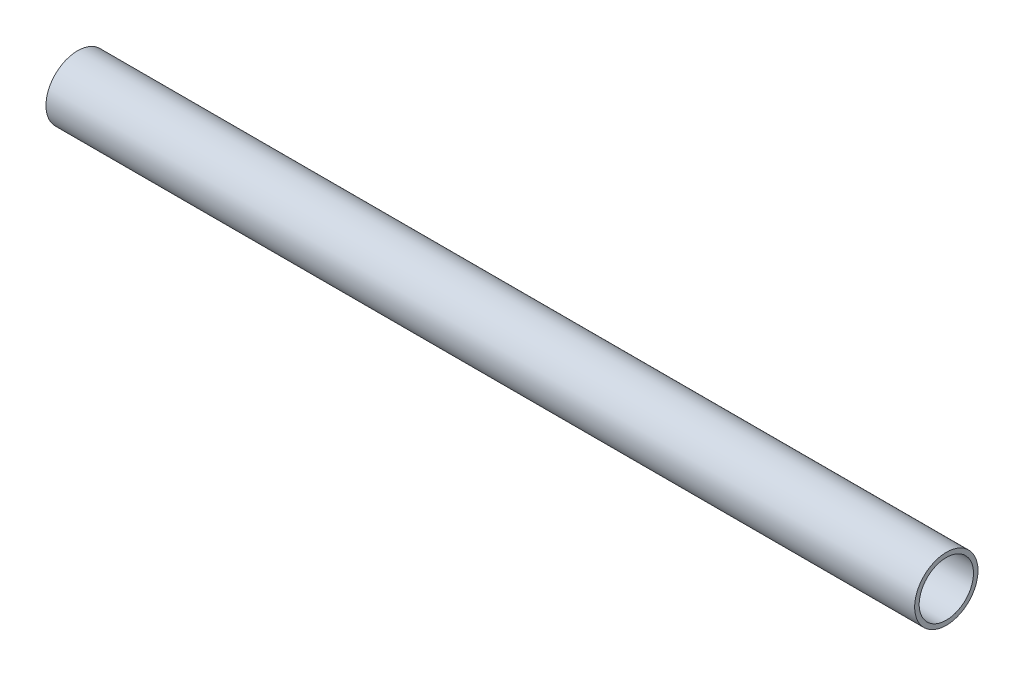
ISO-10303-21;
HEADER;
FILE_DESCRIPTION(('STEP AP214'),'2;1');
FILE_NAME('part.step','',(''),(''),'','','');
FILE_SCHEMA(('AUTOMOTIVE_DESIGN { 1 0 10303 214 1 1 1 1 }'));
ENDSEC;
DATA;
#1=APPLICATION_CONTEXT('core data for automotive mechanical design processes');
#2=APPLICATION_PROTOCOL_DEFINITION('international standard','automotive_design',2000,#1);
#3=PRODUCT_CONTEXT('',#1,'mechanical');
#4=PRODUCT('Part','Part','',(#3));
#5=PRODUCT_RELATED_PRODUCT_CATEGORY('part','',(#4));
#6=PRODUCT_DEFINITION_FORMATION('','',#4);
#7=PRODUCT_DEFINITION_CONTEXT('part definition',#1,'design');
#8=PRODUCT_DEFINITION('design','',#6,#7);
#9=PRODUCT_DEFINITION_SHAPE('','',#8);
#10=(LENGTH_UNIT() NAMED_UNIT(*) SI_UNIT(.MILLI.,.METRE.));
#11=(NAMED_UNIT(*) PLANE_ANGLE_UNIT() SI_UNIT($,.RADIAN.));
#12=(NAMED_UNIT(*) SI_UNIT($,.STERADIAN.) SOLID_ANGLE_UNIT());
#13=UNCERTAINTY_MEASURE_WITH_UNIT(LENGTH_MEASURE(1.E-05),#10,'distance_accuracy_value','');
#14=(GEOMETRIC_REPRESENTATION_CONTEXT(3) GLOBAL_UNCERTAINTY_ASSIGNED_CONTEXT((#13)) GLOBAL_UNIT_ASSIGNED_CONTEXT((#10,
#11,#12)) REPRESENTATION_CONTEXT('',''));
#15=CARTESIAN_POINT('',(0.,0.,0.));
#16=DIRECTION('',(0.,0.,1.));
#17=DIRECTION('',(1.,0.,0.));
#18=AXIS2_PLACEMENT_3D('',#15,#16,#17);
#19=CARTESIAN_POINT('',(609.6,0.,0.));
#20=DIRECTION('',(1.,0.,0.));
#21=DIRECTION('',(0.,0.,-1.));
#22=AXIS2_PLACEMENT_3D('',#19,#20,#21);
#23=PLANE('',#22);
#24=CARTESIAN_POINT('',(609.6,0.,0.));
#25=DIRECTION('',(1.,0.,0.));
#26=DIRECTION('',(0.,0.,-1.));
#27=AXIS2_PLACEMENT_3D('',#24,#25,#26);
#28=CIRCLE('',#27,44.45);
#29=CARTESIAN_POINT('',(609.6,0.,-44.45));
#30=VERTEX_POINT('',#29);
#31=EDGE_CURVE('E10',#30,#30,#28,.T.);
#32=ORIENTED_EDGE('',*,*,#31,.T.);
#33=EDGE_LOOP('',(#32));
#34=FACE_BOUND('',#33,.T.);
#35=CARTESIAN_POINT('',(609.6,0.,0.));
#36=DIRECTION('',(1.,0.,0.));
#37=DIRECTION('',(0.,0.,-1.));
#38=AXIS2_PLACEMENT_3D('',#35,#36,#37);
#39=CIRCLE('',#38,38.1);
#40=CARTESIAN_POINT('',(609.6,0.,-38.1));
#41=VERTEX_POINT('',#40);
#42=EDGE_CURVE('E42',#41,#41,#39,.T.);
#43=ORIENTED_EDGE('',*,*,#42,.F.);
#44=EDGE_LOOP('',(#43));
#45=FACE_BOUND('',#44,.T.);
#46=ADVANCED_FACE('F31',(#34,#45),#23,.T.);
#47=CARTESIAN_POINT('',(-609.6,0.,0.));
#48=DIRECTION('',(1.,0.,0.));
#49=DIRECTION('',(0.,0.,-1.));
#50=AXIS2_PLACEMENT_3D('',#47,#48,#49);
#51=PLANE('',#50);
#52=CARTESIAN_POINT('',(-609.6,0.,0.));
#53=DIRECTION('',(1.,0.,0.));
#54=DIRECTION('',(0.,0.,-1.));
#55=AXIS2_PLACEMENT_3D('',#52,#53,#54);
#56=CIRCLE('',#55,44.45);
#57=CARTESIAN_POINT('',(-609.6,0.,-44.45));
#58=VERTEX_POINT('',#57);
#59=EDGE_CURVE('E35',#58,#58,#56,.T.);
#60=ORIENTED_EDGE('',*,*,#59,.F.);
#61=EDGE_LOOP('',(#60));
#62=FACE_BOUND('',#61,.T.);
#63=CARTESIAN_POINT('',(-609.6,0.,0.));
#64=DIRECTION('',(1.,0.,0.));
#65=DIRECTION('',(0.,0.,-1.));
#66=AXIS2_PLACEMENT_3D('',#63,#64,#65);
#67=CIRCLE('',#66,38.1);
#68=CARTESIAN_POINT('',(-609.6,0.,-38.1));
#69=VERTEX_POINT('',#68);
#70=EDGE_CURVE('E44',#69,#69,#67,.T.);
#71=ORIENTED_EDGE('',*,*,#70,.T.);
#72=EDGE_LOOP('',(#71));
#73=FACE_BOUND('',#72,.T.);
#74=ADVANCED_FACE('F54',(#62,#73),#51,.F.);
#75=CARTESIAN_POINT('',(609.6,0.,0.));
#76=DIRECTION('',(-1.,0.,0.));
#77=DIRECTION('',(0.,0.,1.));
#78=AXIS2_PLACEMENT_3D('',#75,#76,#77);
#79=CYLINDRICAL_SURFACE('',#78,44.45);
#80=ORIENTED_EDGE('',*,*,#31,.F.);
#81=EDGE_LOOP('',(#80));
#82=FACE_BOUND('',#81,.T.);
#83=ORIENTED_EDGE('',*,*,#59,.T.);
#84=EDGE_LOOP('',(#83));
#85=FACE_BOUND('',#84,.T.);
#86=ADVANCED_FACE('F33',(#82,#85),#79,.T.);
#87=CARTESIAN_POINT('',(609.6,0.,0.));
#88=DIRECTION('',(-1.,0.,0.));
#89=DIRECTION('',(0.,0.,1.));
#90=AXIS2_PLACEMENT_3D('',#87,#88,#89);
#91=CYLINDRICAL_SURFACE('',#90,38.1);
#92=ORIENTED_EDGE('',*,*,#42,.T.);
#93=EDGE_LOOP('',(#92));
#94=FACE_BOUND('',#93,.T.);
#95=ORIENTED_EDGE('',*,*,#70,.F.);
#96=EDGE_LOOP('',(#95));
#97=FACE_BOUND('',#96,.T.);
#98=ADVANCED_FACE('F50',(#94,#97),#91,.F.);
#99=CLOSED_SHELL('',(#46,#74,#86,#98));
#100=MANIFOLD_SOLID_BREP('B2',#99);
#101=ADVANCED_BREP_SHAPE_REPRESENTATION('',(#18,#100),#14);
#102=SHAPE_DEFINITION_REPRESENTATION(#9,#101);
ENDSEC;
END-ISO-10303-21;
